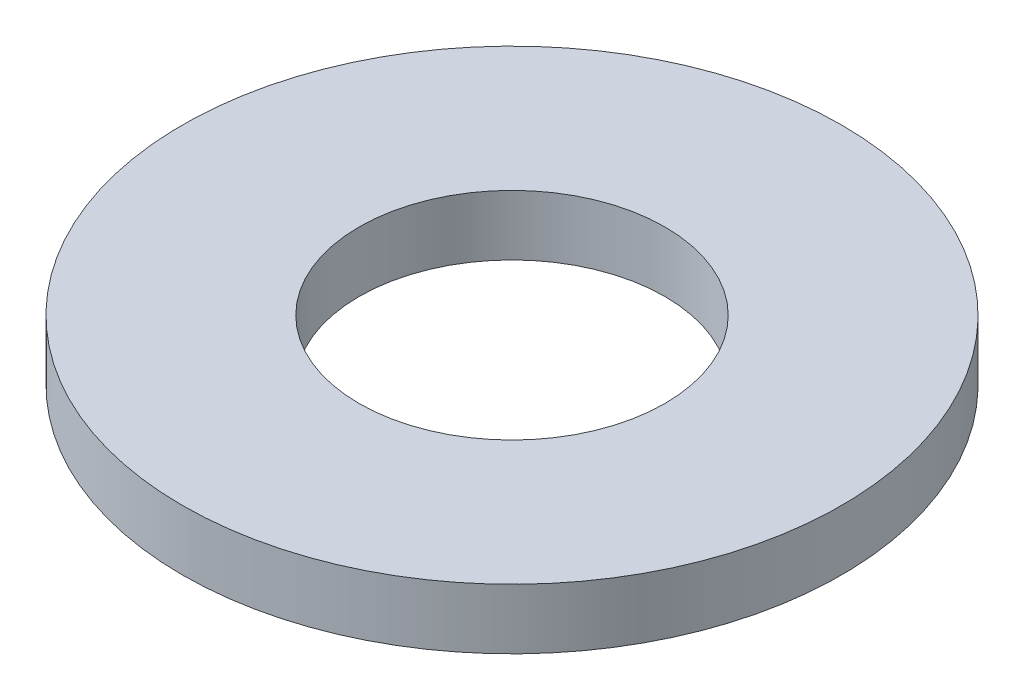
ISO-10303-21;
HEADER;
FILE_DESCRIPTION(('STEP AP214'),'2;1');
FILE_NAME('part.step','',(''),(''),'','','');
FILE_SCHEMA(('AUTOMOTIVE_DESIGN { 1 0 10303 214 1 1 1 1 }'));
ENDSEC;
DATA;
#1=APPLICATION_CONTEXT('core data for automotive mechanical design processes');
#2=APPLICATION_PROTOCOL_DEFINITION('international standard','automotive_design',2000,#1);
#3=PRODUCT_CONTEXT('',#1,'mechanical');
#4=PRODUCT('Part','Part','',(#3));
#5=PRODUCT_RELATED_PRODUCT_CATEGORY('part','',(#4));
#6=PRODUCT_DEFINITION_FORMATION('','',#4);
#7=PRODUCT_DEFINITION_CONTEXT('part definition',#1,'design');
#8=PRODUCT_DEFINITION('design','',#6,#7);
#9=PRODUCT_DEFINITION_SHAPE('','',#8);
#10=(LENGTH_UNIT() NAMED_UNIT(*) SI_UNIT(.MILLI.,.METRE.));
#11=(NAMED_UNIT(*) PLANE_ANGLE_UNIT() SI_UNIT($,.RADIAN.));
#12=(NAMED_UNIT(*) SI_UNIT($,.STERADIAN.) SOLID_ANGLE_UNIT());
#13=UNCERTAINTY_MEASURE_WITH_UNIT(LENGTH_MEASURE(1.E-05),#10,'distance_accuracy_value','');
#14=(GEOMETRIC_REPRESENTATION_CONTEXT(3) GLOBAL_UNCERTAINTY_ASSIGNED_CONTEXT((#13)) GLOBAL_UNIT_ASSIGNED_CONTEXT((#10,
#11,#12)) REPRESENTATION_CONTEXT('',''));
#15=CARTESIAN_POINT('',(0.,0.,0.));
#16=DIRECTION('',(0.,0.,1.));
#17=DIRECTION('',(1.,0.,0.));
#18=AXIS2_PLACEMENT_3D('',#15,#16,#17);
#19=CARTESIAN_POINT('',(0.,1.016,0.));
#20=DIRECTION('',(0.,-1.,0.));
#21=DIRECTION('',(0.,0.,-1.));
#22=AXIS2_PLACEMENT_3D('',#19,#20,#21);
#23=CYLINDRICAL_SURFACE('',#22,5.55625);
#24=CARTESIAN_POINT('',(0.,1.016,0.));
#25=DIRECTION('',(0.,1.,0.));
#26=DIRECTION('',(0.,0.,1.));
#27=AXIS2_PLACEMENT_3D('',#24,#25,#26);
#28=CIRCLE('',#27,5.55625);
#29=CARTESIAN_POINT('',(0.,1.016,5.55625));
#30=VERTEX_POINT('',#29);
#31=EDGE_CURVE('E10',#30,#30,#28,.T.);
#32=ORIENTED_EDGE('',*,*,#31,.F.);
#33=EDGE_LOOP('',(#32));
#34=FACE_BOUND('',#33,.T.);
#35=CARTESIAN_POINT('',(0.,0.,0.));
#36=DIRECTION('',(0.,1.,0.));
#37=DIRECTION('',(0.,0.,1.));
#38=AXIS2_PLACEMENT_3D('',#35,#36,#37);
#39=CIRCLE('',#38,5.55625);
#40=CARTESIAN_POINT('',(0.,0.,5.55625));
#41=VERTEX_POINT('',#40);
#42=EDGE_CURVE('E33',#41,#41,#39,.T.);
#43=ORIENTED_EDGE('',*,*,#42,.T.);
#44=EDGE_LOOP('',(#43));
#45=FACE_BOUND('',#44,.T.);
#46=ADVANCED_FACE('F30',(#34,#45),#23,.T.);
#47=CARTESIAN_POINT('',(0.,1.016,0.));
#48=DIRECTION('',(0.,1.,0.));
#49=DIRECTION('',(0.,0.,1.));
#50=AXIS2_PLACEMENT_3D('',#47,#48,#49);
#51=PLANE('',#50);
#52=CARTESIAN_POINT('',(0.,1.016,0.));
#53=DIRECTION('',(0.,1.,0.));
#54=DIRECTION('',(0.,0.,1.));
#55=AXIS2_PLACEMENT_3D('',#52,#53,#54);
#56=CIRCLE('',#55,2.5781);
#57=CARTESIAN_POINT('',(0.,1.016,2.5781));
#58=VERTEX_POINT('',#57);
#59=EDGE_CURVE('E42',#58,#58,#56,.T.);
#60=ORIENTED_EDGE('',*,*,#59,.F.);
#61=EDGE_LOOP('',(#60));
#62=FACE_BOUND('',#61,.T.);
#63=ORIENTED_EDGE('',*,*,#31,.T.);
#64=EDGE_LOOP('',(#63));
#65=FACE_BOUND('',#64,.T.);
#66=ADVANCED_FACE('F57',(#62,#65),#51,.T.);
#67=CARTESIAN_POINT('',(0.,0.,0.));
#68=DIRECTION('',(0.,1.,0.));
#69=DIRECTION('',(0.,0.,1.));
#70=AXIS2_PLACEMENT_3D('',#67,#68,#69);
#71=PLANE('',#70);
#72=CARTESIAN_POINT('',(0.,0.,0.));
#73=DIRECTION('',(0.,1.,0.));
#74=DIRECTION('',(0.,0.,1.));
#75=AXIS2_PLACEMENT_3D('',#72,#73,#74);
#76=CIRCLE('',#75,2.5781);
#77=CARTESIAN_POINT('',(0.,0.,2.5781));
#78=VERTEX_POINT('',#77);
#79=EDGE_CURVE('E40',#78,#78,#76,.T.);
#80=ORIENTED_EDGE('',*,*,#79,.T.);
#81=EDGE_LOOP('',(#80));
#82=FACE_BOUND('',#81,.T.);
#83=ORIENTED_EDGE('',*,*,#42,.F.);
#84=EDGE_LOOP('',(#83));
#85=FACE_BOUND('',#84,.T.);
#86=ADVANCED_FACE('F48',(#82,#85),#71,.F.);
#87=CARTESIAN_POINT('',(0.,0.,0.));
#88=DIRECTION('',(0.,1.,0.));
#89=DIRECTION('',(0.,0.,1.));
#90=AXIS2_PLACEMENT_3D('',#87,#88,#89);
#91=CYLINDRICAL_SURFACE('',#90,2.5781);
#92=ORIENTED_EDGE('',*,*,#79,.F.);
#93=EDGE_LOOP('',(#92));
#94=FACE_BOUND('',#93,.T.);
#95=ORIENTED_EDGE('',*,*,#59,.T.);
#96=EDGE_LOOP('',(#95));
#97=FACE_BOUND('',#96,.T.);
#98=ADVANCED_FACE('F51',(#94,#97),#91,.F.);
#99=CLOSED_SHELL('',(#46,#66,#86,#98));
#100=MANIFOLD_SOLID_BREP('B2',#99);
#101=ADVANCED_BREP_SHAPE_REPRESENTATION('',(#18,#100),#14);
#102=SHAPE_DEFINITION_REPRESENTATION(#9,#101);
ENDSEC;
END-ISO-10303-21;
